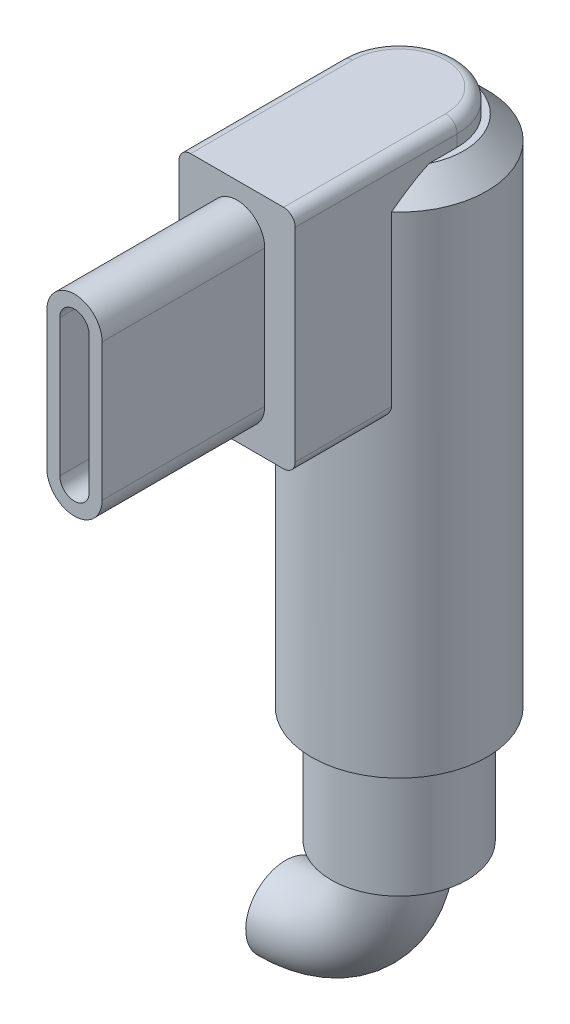
ISO-10303-21;
HEADER;
FILE_DESCRIPTION(('STEP AP214'),'2;1');
FILE_NAME('part.step','',(''),(''),'','','');
FILE_SCHEMA(('AUTOMOTIVE_DESIGN { 1 0 10303 214 1 1 1 1 }'));
ENDSEC;
DATA;
#1=APPLICATION_CONTEXT('core data for automotive mechanical design processes');
#2=APPLICATION_PROTOCOL_DEFINITION('international standard','automotive_design',2000,#1);
#3=PRODUCT_CONTEXT('',#1,'mechanical');
#4=PRODUCT('Part','Part','',(#3));
#5=PRODUCT_RELATED_PRODUCT_CATEGORY('part','',(#4));
#6=PRODUCT_DEFINITION_FORMATION('','',#4);
#7=PRODUCT_DEFINITION_CONTEXT('part definition',#1,'design');
#8=PRODUCT_DEFINITION('design','',#6,#7);
#9=PRODUCT_DEFINITION_SHAPE('','',#8);
#10=(LENGTH_UNIT() NAMED_UNIT(*) SI_UNIT(.MILLI.,.METRE.));
#11=(NAMED_UNIT(*) PLANE_ANGLE_UNIT() SI_UNIT($,.RADIAN.));
#12=(NAMED_UNIT(*) SI_UNIT($,.STERADIAN.) SOLID_ANGLE_UNIT());
#13=UNCERTAINTY_MEASURE_WITH_UNIT(LENGTH_MEASURE(1.E-05),#10,'distance_accuracy_value','');
#14=(GEOMETRIC_REPRESENTATION_CONTEXT(3) GLOBAL_UNCERTAINTY_ASSIGNED_CONTEXT((#13)) GLOBAL_UNIT_ASSIGNED_CONTEXT((#10,
#11,#12)) REPRESENTATION_CONTEXT('',''));
#15=CARTESIAN_POINT('',(0.,0.,0.));
#16=DIRECTION('',(0.,0.,1.));
#17=DIRECTION('',(1.,0.,0.));
#18=AXIS2_PLACEMENT_3D('',#15,#16,#17);
#19=CARTESIAN_POINT('',(0.,28.1,0.));
#20=DIRECTION('',(0.,-1.,0.));
#21=DIRECTION('',(0.,0.,-1.));
#22=AXIS2_PLACEMENT_3D('',#19,#20,#21);
#23=CYLINDRICAL_SURFACE('',#22,3.775);
#24=CARTESIAN_POINT('',(0.,5.,0.));
#25=DIRECTION('',(0.,1.,0.));
#26=DIRECTION('',(0.,0.,1.));
#27=AXIS2_PLACEMENT_3D('',#24,#25,#26);
#28=CIRCLE('',#27,3.775);
#29=CARTESIAN_POINT('',(0.,5.,3.775));
#30=VERTEX_POINT('',#29);
#31=EDGE_CURVE('E335',#30,#30,#28,.T.);
#32=ORIENTED_EDGE('',*,*,#31,.T.);
#33=EDGE_LOOP('',(#32));
#34=FACE_BOUND('',#33,.T.);
#35=DIRECTION('',(0.,-1.,0.));
#36=VECTOR('',#35,1.);
#37=CARTESIAN_POINT('',(-2.5,28.1,2.82853760802292));
#38=LINE('',#37,#36);
#39=CARTESIAN_POINT('',(-2.5,26.1,2.82853760802292));
#40=VERTEX_POINT('',#39);
#41=CARTESIAN_POINT('',(-2.5,18.85,2.82853760802292));
#42=VERTEX_POINT('',#41);
#43=EDGE_CURVE('E308',#40,#42,#38,.T.);
#44=ORIENTED_EDGE('',*,*,#43,.F.);
#45=CARTESIAN_POINT('',(0.,26.1,0.));
#46=DIRECTION('',(0.,1.,0.));
#47=DIRECTION('',(0.,0.,1.));
#48=AXIS2_PLACEMENT_3D('',#45,#46,#47);
#49=CIRCLE('',#48,3.775);
#50=CARTESIAN_POINT('',(2.5,26.1,2.82853760802292));
#51=VERTEX_POINT('',#50);
#52=EDGE_CURVE('E350',#40,#51,#49,.F.);
#53=ORIENTED_EDGE('',*,*,#52,.T.);
#54=DIRECTION('',(0.,-1.,0.));
#55=VECTOR('',#54,1.);
#56=CARTESIAN_POINT('',(2.5,28.1,2.82853760802292));
#57=LINE('',#56,#55);
#58=CARTESIAN_POINT('',(2.5,18.85,2.82853760802292));
#59=VERTEX_POINT('',#58);
#60=EDGE_CURVE('E312',#59,#51,#57,.F.);
#61=ORIENTED_EDGE('',*,*,#60,.F.);
#62=CARTESIAN_POINT('',(2.5,18.85,2.82853760802292));
#63=CARTESIAN_POINT('',(2.5000369379469,18.826457102281,2.82849614022547));
#64=CARTESIAN_POINT('',(2.49833999016514,18.8029734489008,2.8300050813574));
#65=CARTESIAN_POINT('',(2.49180621462881,18.7569883192918,2.8357641199373));
#66=CARTESIAN_POINT('',(2.48699602477203,18.734480223276,2.83999096019166));
#67=CARTESIAN_POINT('',(2.47457109758775,18.6909498361622,2.85082196215042));
#68=CARTESIAN_POINT('',(2.46696411444391,18.6699236267678,2.85741954976028));
#69=CARTESIAN_POINT('',(2.44934553663139,18.6296058667352,2.87253677117939));
#70=CARTESIAN_POINT('',(2.43932823042136,18.6103185882128,2.88106096735652));
#71=CARTESIAN_POINT('',(2.41313053460092,18.5668250708692,2.90307005166998));
#72=CARTESIAN_POINT('',(2.39604895389874,18.5434955124402,2.91721512620181));
#73=CARTESIAN_POINT('',(2.35890477449549,18.5007264201281,2.94733217504659));
#74=CARTESIAN_POINT('',(2.33883833515682,18.4812919748771,2.96330649687753));
#75=CARTESIAN_POINT('',(2.2959948591727,18.4460586800113,2.99662818692633));
#76=CARTESIAN_POINT('',(2.27317815287008,18.4303259628401,3.0139940295335));
#77=CARTESIAN_POINT('',(2.22562996398549,18.4029615910862,3.04927452193336));
#78=CARTESIAN_POINT('',(2.2008993059963,18.3913281822522,3.06718893339641));
#79=CARTESIAN_POINT('',(2.14758041771138,18.3713521145292,3.10478245415861));
#80=CARTESIAN_POINT('',(2.11884692516726,18.3634130958183,3.12447160106304));
#81=CARTESIAN_POINT('',(2.06017590948722,18.3527419858257,3.16347465852328));
#82=CARTESIAN_POINT('',(2.03023807377893,18.3500112553102,3.18278846971109));
#83=CARTESIAN_POINT('',(2.,18.35,3.20165972582971));
#84=B_SPLINE_CURVE_WITH_KNOTS('',3,(#62,#63,#64,#65,#66,#67,#68,#69,#70,#71,#72,#73,#74,#75,#76,
#77,#78,#79,#80,#81,#82,#83),.UNSPECIFIED.,.F.,.F.,(4,2,2,2,2,2,2,2,2,2,4),(0.,
0.0704255173164462,0.140256278059766,0.209894873453453,0.279700139499729,0.375748188194619,
0.471920909067463,0.569699667782268,0.667436532255682,0.774208802935048,0.881008966119465),.UNSPECIFIED.);
#85=CARTESIAN_POINT('',(2.,18.35,3.20165972582971));
#86=VERTEX_POINT('',#85);
#87=EDGE_CURVE('E66',#59,#86,#84,.T.);
#88=ORIENTED_EDGE('',*,*,#87,.T.);
#89=CARTESIAN_POINT('',(0.,18.35,0.));
#90=DIRECTION('',(0.,-1.,0.));
#91=DIRECTION('',(0.,0.,-1.));
#92=AXIS2_PLACEMENT_3D('',#89,#90,#91);
#93=CIRCLE('',#92,3.775);
#94=CARTESIAN_POINT('',(-2.,18.35,3.20165972582971));
#95=VERTEX_POINT('',#94);
#96=EDGE_CURVE('E313',#95,#86,#93,.F.);
#97=ORIENTED_EDGE('',*,*,#96,.F.);
#98=CARTESIAN_POINT('',(-2.,18.35,3.20165972582971));
#99=CARTESIAN_POINT('',(-2.03606850331327,18.3500248556165,3.17916413676862));
#100=CARTESIAN_POINT('',(-2.07169973642586,18.3539008427553,3.15602520589106));
#101=CARTESIAN_POINT('',(-2.14125396079077,18.3690368250493,3.10923780757989));
#102=CARTESIAN_POINT('',(-2.17516849392718,18.3803301489529,3.08558750846223));
#103=CARTESIAN_POINT('',(-2.23803482981118,18.4090282202888,3.04027084309099));
#104=CARTESIAN_POINT('',(-2.26716529912488,18.4259959942354,3.01857431952126));
#105=CARTESIAN_POINT('',(-2.32202388109657,18.4660088804958,2.97657728094078));
#106=CARTESIAN_POINT('',(-2.3477595846894,18.4890400765204,2.95627370177127));
#107=CARTESIAN_POINT('',(-2.38792576050043,18.533560461974,2.92385018278229));
#108=CARTESIAN_POINT('',(-2.40347132912667,18.5535630200646,2.91106357384926));
#109=CARTESIAN_POINT('',(-2.43175099167725,18.5965245498283,2.88748151207099));
#110=CARTESIAN_POINT('',(-2.44448880345045,18.6194795474763,2.87668342930648));
#111=CARTESIAN_POINT('',(-2.46450272287878,18.6636785490475,2.85954428843174));
#112=CARTESIAN_POINT('',(-2.4723490863816,18.6844878771238,2.85275091864194));
#113=CARTESIAN_POINT('',(-2.48528644191277,18.7275291285085,2.84148739434813));
#114=CARTESIAN_POINT('',(-2.49038316632742,18.7497579832965,2.83701240731115));
#115=CARTESIAN_POINT('',(-2.49594463538548,18.7851457922843,2.83211799873875));
#116=CARTESIAN_POINT('',(-2.49746022269047,18.7980242100382,2.83078089201309));
#117=CARTESIAN_POINT('',(-2.49948971376825,18.8239320499596,2.82898865745538));
#118=CARTESIAN_POINT('',(-2.5000026982415,18.8369615997031,2.82853433906561));
#119=CARTESIAN_POINT('',(-2.5,18.85,2.82853760802291));
#120=B_SPLINE_CURVE_WITH_KNOTS('',3,(#98,#99,#100,#101,#102,#103,#104,#105,#106,#107,#108,#109,
#110,#111,#112,#113,#114,#115,#116,#117,#118,#119),.UNSPECIFIED.,.F.,.F.,(4,2,2,2,2,2,2,2,2,2,
4),(0.,0.127315986871851,0.255208000196736,0.374921949854657,0.494363501149973,
0.579198459174759,0.663920400317473,0.733406456844945,0.802747085029367,0.841792147011757,
0.880872993153382),.UNSPECIFIED.);
#121=EDGE_CURVE('E394',#95,#42,#120,.T.);
#122=ORIENTED_EDGE('',*,*,#121,.T.);
#123=EDGE_LOOP('',(#44,#53,#61,#88,#97,#122));
#124=FACE_BOUND('',#123,.T.);
#125=ADVANCED_FACE('F55',(#34,#124),#23,.T.);
#126=CARTESIAN_POINT('',(0.,0.,6.975));
#127=DIRECTION('',(0.,0.,1.));
#128=DIRECTION('',(1.,0.,0.));
#129=AXIS2_PLACEMENT_3D('',#126,#127,#128);
#130=PLANE('',#129);
#131=DIRECTION('',(0.,-1.,0.));
#132=VECTOR('',#131,1.);
#133=CARTESIAN_POINT('',(-2.5,28.1,6.975));
#134=LINE('',#133,#132);
#135=CARTESIAN_POINT('',(-2.5,27.6,6.975));
#136=VERTEX_POINT('',#135);
#137=CARTESIAN_POINT('',(-2.5,18.85,6.975));
#138=VERTEX_POINT('',#137);
#139=EDGE_CURVE('E317',#136,#138,#134,.T.);
#140=ORIENTED_EDGE('',*,*,#139,.T.);
#141=CARTESIAN_POINT('',(-2.,18.85,6.975));
#142=DIRECTION('',(0.,0.,1.));
#143=DIRECTION('',(1.,0.,0.));
#144=AXIS2_PLACEMENT_3D('',#141,#142,#143);
#145=CIRCLE('',#144,0.5);
#146=CARTESIAN_POINT('',(-2.,18.35,6.975));
#147=VERTEX_POINT('',#146);
#148=EDGE_CURVE('E507',#138,#147,#145,.T.);
#149=ORIENTED_EDGE('',*,*,#148,.T.);
#150=DIRECTION('',(1.,0.,0.));
#151=VECTOR('',#150,1.);
#152=CARTESIAN_POINT('',(-2.5,18.35,6.975));
#153=LINE('',#152,#151);
#154=CARTESIAN_POINT('',(2.,18.35,6.975));
#155=VERTEX_POINT('',#154);
#156=EDGE_CURVE('E323',#147,#155,#153,.T.);
#157=ORIENTED_EDGE('',*,*,#156,.T.);
#158=CARTESIAN_POINT('',(2.,18.85,6.975));
#159=DIRECTION('',(0.,0.,1.));
#160=DIRECTION('',(1.,0.,0.));
#161=AXIS2_PLACEMENT_3D('',#158,#159,#160);
#162=CIRCLE('',#161,0.5);
#163=CARTESIAN_POINT('',(2.5,18.85,6.975));
#164=VERTEX_POINT('',#163);
#165=EDGE_CURVE('E522',#155,#164,#162,.T.);
#166=ORIENTED_EDGE('',*,*,#165,.T.);
#167=DIRECTION('',(0.,1.,0.));
#168=VECTOR('',#167,1.);
#169=CARTESIAN_POINT('',(2.5,28.1,6.975));
#170=LINE('',#169,#168);
#171=CARTESIAN_POINT('',(2.5,27.6,6.975));
#172=VERTEX_POINT('',#171);
#173=EDGE_CURVE('E327',#164,#172,#170,.T.);
#174=ORIENTED_EDGE('',*,*,#173,.T.);
#175=CARTESIAN_POINT('',(2.,27.6,6.975));
#176=DIRECTION('',(0.,0.,1.));
#177=DIRECTION('',(1.,0.,0.));
#178=AXIS2_PLACEMENT_3D('',#175,#176,#177);
#179=CIRCLE('',#178,0.5);
#180=CARTESIAN_POINT('',(2.,28.1,6.975));
#181=VERTEX_POINT('',#180);
#182=EDGE_CURVE('E519',#172,#181,#179,.T.);
#183=ORIENTED_EDGE('',*,*,#182,.T.);
#184=DIRECTION('',(-1.,0.,0.));
#185=VECTOR('',#184,1.);
#186=CARTESIAN_POINT('',(-2.5,28.1,6.975));
#187=LINE('',#186,#185);
#188=CARTESIAN_POINT('',(-2.,28.1,6.975));
#189=VERTEX_POINT('',#188);
#190=EDGE_CURVE('E331',#181,#189,#187,.T.);
#191=ORIENTED_EDGE('',*,*,#190,.T.);
#192=CARTESIAN_POINT('',(-2.,27.6,6.975));
#193=DIRECTION('',(0.,0.,1.));
#194=DIRECTION('',(1.,0.,0.));
#195=AXIS2_PLACEMENT_3D('',#192,#193,#194);
#196=CIRCLE('',#195,0.5);
#197=EDGE_CURVE('E525',#189,#136,#196,.T.);
#198=ORIENTED_EDGE('',*,*,#197,.T.);
#199=EDGE_LOOP('',(#140,#149,#157,#166,#174,#183,#191,#198));
#200=FACE_BOUND('',#199,.T.);
#201=DIRECTION('',(0.,-1.,0.));
#202=VECTOR('',#201,1.);
#203=CARTESIAN_POINT('',(-1.19,26.175,6.975));
#204=LINE('',#203,#202);
#205=CARTESIAN_POINT('',(-1.19,26.175,6.975));
#206=VERTEX_POINT('',#205);
#207=CARTESIAN_POINT('',(-1.19,20.275,6.975));
#208=VERTEX_POINT('',#207);
#209=EDGE_CURVE('E286',#206,#208,#204,.T.);
#210=ORIENTED_EDGE('',*,*,#209,.F.);
#211=CARTESIAN_POINT('',(0.,26.175,6.975));
#212=DIRECTION('',(0.,0.,1.));
#213=DIRECTION('',(1.,0.,0.));
#214=AXIS2_PLACEMENT_3D('',#211,#212,#213);
#215=CIRCLE('',#214,1.19);
#216=CARTESIAN_POINT('',(1.19,26.175,6.975));
#217=VERTEX_POINT('',#216);
#218=EDGE_CURVE('E267',#217,#206,#215,.T.);
#219=ORIENTED_EDGE('',*,*,#218,.F.);
#220=DIRECTION('',(0.,1.,0.));
#221=VECTOR('',#220,1.);
#222=CARTESIAN_POINT('',(1.19,26.175,6.975));
#223=LINE('',#222,#221);
#224=CARTESIAN_POINT('',(1.19,20.275,6.975));
#225=VERTEX_POINT('',#224);
#226=EDGE_CURVE('E273',#225,#217,#223,.T.);
#227=ORIENTED_EDGE('',*,*,#226,.F.);
#228=CARTESIAN_POINT('',(0.,20.275,6.975));
#229=DIRECTION('',(0.,0.,1.));
#230=DIRECTION('',(1.,0.,0.));
#231=AXIS2_PLACEMENT_3D('',#228,#229,#230);
#232=CIRCLE('',#231,1.19);
#233=EDGE_CURVE('E289',#208,#225,#232,.T.);
#234=ORIENTED_EDGE('',*,*,#233,.F.);
#235=EDGE_LOOP('',(#210,#219,#227,#234));
#236=FACE_BOUND('',#235,.T.);
#237=ADVANCED_FACE('F412',(#200,#236),#130,.T.);
#238=CARTESIAN_POINT('',(0.,5.,0.));
#239=DIRECTION('',(0.,-1.,0.));
#240=DIRECTION('',(0.,0.,-1.));
#241=AXIS2_PLACEMENT_3D('',#238,#239,#240);
#242=CYLINDRICAL_SURFACE('',#241,2.925);
#243=CARTESIAN_POINT('',(0.,5.,0.));
#244=DIRECTION('',(0.,1.,0.));
#245=DIRECTION('',(0.,0.,1.));
#246=AXIS2_PLACEMENT_3D('',#243,#244,#245);
#247=CIRCLE('',#246,2.925);
#248=CARTESIAN_POINT('',(0.,5.,2.925));
#249=VERTEX_POINT('',#248);
#250=EDGE_CURVE('E340',#249,#249,#247,.T.);
#251=ORIENTED_EDGE('',*,*,#250,.F.);
#252=EDGE_LOOP('',(#251));
#253=FACE_BOUND('',#252,.T.);
#254=CARTESIAN_POINT('',(0.,0.,0.));
#255=DIRECTION('',(0.,1.,0.));
#256=DIRECTION('',(0.,0.,1.));
#257=AXIS2_PLACEMENT_3D('',#254,#255,#256);
#258=CIRCLE('',#257,2.925);
#259=CARTESIAN_POINT('',(0.,0.,2.925));
#260=VERTEX_POINT('',#259);
#261=EDGE_CURVE('E339',#260,#260,#258,.T.);
#262=ORIENTED_EDGE('',*,*,#261,.T.);
#263=EDGE_LOOP('',(#262));
#264=FACE_BOUND('',#263,.T.);
#265=ADVANCED_FACE('F383',(#253,#264),#242,.T.);
#266=CARTESIAN_POINT('',(0.,0.,0.));
#267=DIRECTION('',(0.,1.,0.));
#268=DIRECTION('',(0.,0.,1.));
#269=AXIS2_PLACEMENT_3D('',#266,#267,#268);
#270=PLANE('',#269);
#271=CARTESIAN_POINT('',(0.,0.,0.));
#272=DIRECTION('',(0.,-1.,0.));
#273=DIRECTION('',(0.,0.,-1.));
#274=AXIS2_PLACEMENT_3D('',#271,#272,#273);
#275=CIRCLE('',#274,1.7145);
#276=CARTESIAN_POINT('',(1.7145,0.,0.));
#277=VERTEX_POINT('',#276);
#278=EDGE_CURVE('E13',#277,#277,#275,.T.);
#279=ORIENTED_EDGE('',*,*,#278,.F.);
#280=EDGE_LOOP('',(#279));
#281=FACE_BOUND('',#280,.T.);
#282=ORIENTED_EDGE('',*,*,#261,.F.);
#283=EDGE_LOOP('',(#282));
#284=FACE_BOUND('',#283,.T.);
#285=ADVANCED_FACE('F415',(#281,#284),#270,.F.);
#286=CARTESIAN_POINT('',(0.,28.1,0.));
#287=DIRECTION('',(0.,1.,0.));
#288=DIRECTION('',(0.,0.,1.));
#289=AXIS2_PLACEMENT_3D('',#286,#287,#288);
#290=PLANE('',#289);
#291=CARTESIAN_POINT('',(0.,28.1,0.));
#292=DIRECTION('',(0.,1.,0.));
#293=DIRECTION('',(0.,0.,1.));
#294=AXIS2_PLACEMENT_3D('',#291,#292,#293);
#295=CIRCLE('',#294,2.);
#296=CARTESIAN_POINT('',(2.,28.1,0.));
#297=VERTEX_POINT('',#296);
#298=CARTESIAN_POINT('',(-2.,28.1,0.));
#299=VERTEX_POINT('',#298);
#300=EDGE_CURVE('E533',#297,#299,#295,.T.);
#301=ORIENTED_EDGE('',*,*,#300,.T.);
#302=DIRECTION('',(0.,0.,-1.));
#303=VECTOR('',#302,1.);
#304=CARTESIAN_POINT('',(-2.,28.1,6.975));
#305=LINE('',#304,#303);
#306=EDGE_CURVE('E536',#299,#189,#305,.F.);
#307=ORIENTED_EDGE('',*,*,#306,.T.);
#308=ORIENTED_EDGE('',*,*,#190,.F.);
#309=DIRECTION('',(0.,0.,-1.));
#310=VECTOR('',#309,1.);
#311=CARTESIAN_POINT('',(2.,28.1,0.));
#312=LINE('',#311,#310);
#313=EDGE_CURVE('E530',#181,#297,#312,.T.);
#314=ORIENTED_EDGE('',*,*,#313,.T.);
#315=EDGE_LOOP('',(#301,#307,#308,#314));
#316=FACE_BOUND('',#315,.T.);
#317=ADVANCED_FACE('F418',(#316),#290,.T.);
#318=CARTESIAN_POINT('',(0.,5.,0.));
#319=DIRECTION('',(0.,1.,0.));
#320=DIRECTION('',(0.,0.,1.));
#321=AXIS2_PLACEMENT_3D('',#318,#319,#320);
#322=PLANE('',#321);
#323=ORIENTED_EDGE('',*,*,#250,.T.);
#324=EDGE_LOOP('',(#323));
#325=FACE_BOUND('',#324,.T.);
#326=ORIENTED_EDGE('',*,*,#31,.F.);
#327=EDGE_LOOP('',(#326));
#328=FACE_BOUND('',#327,.T.);
#329=ADVANCED_FACE('F414',(#325,#328),#322,.F.);
#330=CARTESIAN_POINT('',(-2.5,28.1,6.975));
#331=DIRECTION('',(1.,0.,0.));
#332=DIRECTION('',(0.,1.,0.));
#333=AXIS2_PLACEMENT_3D('',#330,#331,#332);
#334=PLANE('',#333);
#335=ORIENTED_EDGE('',*,*,#43,.T.);
#336=DIRECTION('',(0.,0.,-1.));
#337=VECTOR('',#336,1.);
#338=CARTESIAN_POINT('',(-2.5,18.85,6.975));
#339=LINE('',#338,#337);
#340=EDGE_CURVE('E514',#42,#138,#339,.F.);
#341=ORIENTED_EDGE('',*,*,#340,.T.);
#342=ORIENTED_EDGE('',*,*,#139,.F.);
#343=DIRECTION('',(0.,0.,-1.));
#344=VECTOR('',#343,1.);
#345=CARTESIAN_POINT('',(-2.5,27.6,0.));
#346=LINE('',#345,#344);
#347=CARTESIAN_POINT('',(-2.5,27.6,0.));
#348=VERTEX_POINT('',#347);
#349=EDGE_CURVE('E509',#136,#348,#346,.T.);
#350=ORIENTED_EDGE('',*,*,#349,.T.);
#351=DIRECTION('',(0.,1.,0.));
#352=VECTOR('',#351,1.);
#353=CARTESIAN_POINT('',(-2.5,27.1,0.));
#354=LINE('',#353,#352);
#355=CARTESIAN_POINT('',(-2.5,27.1,0.));
#356=VERTEX_POINT('',#355);
#357=EDGE_CURVE('E197',#356,#348,#354,.T.);
#358=ORIENTED_EDGE('',*,*,#357,.F.);
#359=DIRECTION('',(0.,0.,-1.));
#360=VECTOR('',#359,1.);
#361=CARTESIAN_POINT('',(-2.5,27.1,0.));
#362=LINE('',#361,#360);
#363=CARTESIAN_POINT('',(-2.5,27.1,1.20441894704457));
#364=VERTEX_POINT('',#363);
#365=EDGE_CURVE('E198',#364,#356,#362,.T.);
#366=ORIENTED_EDGE('',*,*,#365,.F.);
#367=CARTESIAN_POINT('',(-2.5,27.1,1.20441894704457));
#368=CARTESIAN_POINT('',(-2.5,27.06817489987,1.27769798374855));
#369=CARTESIAN_POINT('',(-2.5,27.0344138305237,1.3501012406047));
#370=CARTESIAN_POINT('',(-2.5,26.9636575458132,1.49325643323808));
#371=CARTESIAN_POINT('',(-2.5,26.9266644504029,1.56400941344375));
#372=CARTESIAN_POINT('',(-2.5,26.8501576305321,1.70384225563926));
#373=CARTESIAN_POINT('',(-2.5,26.8106520753071,1.77292662426145));
#374=CARTESIAN_POINT('',(-2.5,26.729468136726,1.90981786602526));
#375=CARTESIAN_POINT('',(-2.5,26.6877893640542,1.97762450728912));
#376=CARTESIAN_POINT('',(-2.5,26.5602247200458,2.1791237837645));
#377=CARTESIAN_POINT('',(-2.5,26.4716772433656,2.31113321834032));
#378=CARTESIAN_POINT('',(-2.5,26.3350114179661,2.50672696361921));
#379=CARTESIAN_POINT('',(-2.5,26.2887375177751,2.57162431907002));
#380=CARTESIAN_POINT('',(-2.5,26.1951252312258,2.70063805607783));
#381=CARTESIAN_POINT('',(-2.5,26.1477869455196,2.76475451060295));
#382=CARTESIAN_POINT('',(-2.5,26.1,2.82853760802291));
#383=B_SPLINE_CURVE_WITH_KNOTS('',3,(#367,#368,#369,#370,#371,#372,#373,#374,#375,#376,#377,
#378,#379,#380,#381,#382),.UNSPECIFIED.,.F.,.F.,(4,2,2,2,2,2,2,4),(0.,0.239599889392296,
0.479043783407813,0.717745420353795,0.956489966819155,1.43316333775114,1.67227360257733,
1.9113613505981),.UNSPECIFIED.);
#384=EDGE_CURVE('E354',#364,#40,#383,.T.);
#385=ORIENTED_EDGE('',*,*,#384,.T.);
#386=EDGE_LOOP('',(#335,#341,#342,#350,#358,#366,#385));
#387=FACE_BOUND('',#386,.T.);
#388=ADVANCED_FACE('F369',(#387),#334,.F.);
#389=CARTESIAN_POINT('',(-2.5,18.35,6.975));
#390=DIRECTION('',(0.,1.,0.));
#391=DIRECTION('',(0.,0.,1.));
#392=AXIS2_PLACEMENT_3D('',#389,#390,#391);
#393=PLANE('',#392);
#394=ORIENTED_EDGE('',*,*,#156,.F.);
#395=DIRECTION('',(0.,0.,-1.));
#396=VECTOR('',#395,1.);
#397=CARTESIAN_POINT('',(-2.,18.35,6.975));
#398=LINE('',#397,#396);
#399=EDGE_CURVE('E500',#147,#95,#398,.T.);
#400=ORIENTED_EDGE('',*,*,#399,.T.);
#401=ORIENTED_EDGE('',*,*,#96,.T.);
#402=DIRECTION('',(0.,0.,-1.));
#403=VECTOR('',#402,1.);
#404=CARTESIAN_POINT('',(2.,18.35,6.975));
#405=LINE('',#404,#403);
#406=EDGE_CURVE('E502',#86,#155,#405,.F.);
#407=ORIENTED_EDGE('',*,*,#406,.T.);
#408=EDGE_LOOP('',(#394,#400,#401,#407));
#409=FACE_BOUND('',#408,.T.);
#410=ADVANCED_FACE('F490',(#409),#393,.F.);
#411=CARTESIAN_POINT('',(2.5,28.1,6.975));
#412=DIRECTION('',(-1.,0.,0.));
#413=DIRECTION('',(0.,-1.,0.));
#414=AXIS2_PLACEMENT_3D('',#411,#412,#413);
#415=PLANE('',#414);
#416=ORIENTED_EDGE('',*,*,#173,.F.);
#417=DIRECTION('',(0.,0.,-1.));
#418=VECTOR('',#417,1.);
#419=CARTESIAN_POINT('',(2.5,18.85,6.975));
#420=LINE('',#419,#418);
#421=EDGE_CURVE('E403',#164,#59,#420,.T.);
#422=ORIENTED_EDGE('',*,*,#421,.T.);
#423=ORIENTED_EDGE('',*,*,#60,.T.);
#424=CARTESIAN_POINT('',(2.5,26.1,2.82853760802292));
#425=CARTESIAN_POINT('',(2.5,26.1477869455196,2.76475451060296));
#426=CARTESIAN_POINT('',(2.5,26.1951252312258,2.70063805607783));
#427=CARTESIAN_POINT('',(2.5,26.2887375177751,2.57162431907002));
#428=CARTESIAN_POINT('',(2.5,26.3350114179661,2.50672696361921));
#429=CARTESIAN_POINT('',(2.5,26.4716772433656,2.31113321834032));
#430=CARTESIAN_POINT('',(2.5,26.5602247200458,2.1791237837645));
#431=CARTESIAN_POINT('',(2.5,26.6877893640542,1.97762450728912));
#432=CARTESIAN_POINT('',(2.5,26.729468136726,1.90981786602526));
#433=CARTESIAN_POINT('',(2.5,26.8106520753071,1.77292662426145));
#434=CARTESIAN_POINT('',(2.5,26.8501576305321,1.70384225563926));
#435=CARTESIAN_POINT('',(2.5,26.9266644504029,1.56400941344376));
#436=CARTESIAN_POINT('',(2.5,26.9636575458132,1.49325643323808));
#437=CARTESIAN_POINT('',(2.5,27.0344138305237,1.3501012406047));
#438=CARTESIAN_POINT('',(2.5,27.06817489987,1.27769798374855));
#439=CARTESIAN_POINT('',(2.5,27.1,1.20441894704458));
#440=B_SPLINE_CURVE_WITH_KNOTS('',3,(#424,#425,#426,#427,#428,#429,#430,#431,#432,#433,#434,
#435,#436,#437,#438,#439),.UNSPECIFIED.,.F.,.F.,(4,2,2,2,2,2,2,4),(0.,0.239087748020767,
0.478198012846965,0.954871383778947,1.19361593024431,1.43231756719029,1.6717614612058,
1.9113613505981),.UNSPECIFIED.);
#441=CARTESIAN_POINT('',(2.5,27.1,1.20441894704457));
#442=VERTEX_POINT('',#441);
#443=EDGE_CURVE('E205',#51,#442,#440,.T.);
#444=ORIENTED_EDGE('',*,*,#443,.T.);
#445=DIRECTION('',(0.,0.,1.));
#446=VECTOR('',#445,1.);
#447=CARTESIAN_POINT('',(2.5,27.1,0.));
#448=LINE('',#447,#446);
#449=CARTESIAN_POINT('',(2.5,27.1,0.));
#450=VERTEX_POINT('',#449);
#451=EDGE_CURVE('E201',#450,#442,#448,.T.);
#452=ORIENTED_EDGE('',*,*,#451,.F.);
#453=DIRECTION('',(0.,1.,0.));
#454=VECTOR('',#453,1.);
#455=CARTESIAN_POINT('',(2.5,27.1,0.));
#456=LINE('',#455,#454);
#457=CARTESIAN_POINT('',(2.5,27.6,0.));
#458=VERTEX_POINT('',#457);
#459=EDGE_CURVE('E189',#450,#458,#456,.T.);
#460=ORIENTED_EDGE('',*,*,#459,.T.);
#461=DIRECTION('',(0.,0.,-1.));
#462=VECTOR('',#461,1.);
#463=CARTESIAN_POINT('',(2.5,27.6,6.975));
#464=LINE('',#463,#462);
#465=EDGE_CURVE('E540',#458,#172,#464,.F.);
#466=ORIENTED_EDGE('',*,*,#465,.T.);
#467=EDGE_LOOP('',(#416,#422,#423,#444,#452,#460,#466));
#468=FACE_BOUND('',#467,.T.);
#469=ADVANCED_FACE('F203',(#468),#415,.F.);
#470=CARTESIAN_POINT('',(0.,26.175,13.975));
#471=DIRECTION('',(0.,0.,1.));
#472=DIRECTION('',(1.,0.,0.));
#473=AXIS2_PLACEMENT_3D('',#470,#471,#472);
#474=PLANE('',#473);
#475=CARTESIAN_POINT('',(0.,26.175,13.975));
#476=DIRECTION('',(0.,0.,1.));
#477=DIRECTION('',(1.,0.,0.));
#478=AXIS2_PLACEMENT_3D('',#475,#476,#477);
#479=CIRCLE('',#478,1.19);
#480=CARTESIAN_POINT('',(1.19,26.175,13.975));
#481=VERTEX_POINT('',#480);
#482=CARTESIAN_POINT('',(-1.19,26.175,13.975));
#483=VERTEX_POINT('',#482);
#484=EDGE_CURVE('E268',#481,#483,#479,.T.);
#485=ORIENTED_EDGE('',*,*,#484,.T.);
#486=DIRECTION('',(0.,-1.,0.));
#487=VECTOR('',#486,1.);
#488=CARTESIAN_POINT('',(-1.19,26.175,13.975));
#489=LINE('',#488,#487);
#490=CARTESIAN_POINT('',(-1.19,20.275,13.975));
#491=VERTEX_POINT('',#490);
#492=EDGE_CURVE('E272',#483,#491,#489,.T.);
#493=ORIENTED_EDGE('',*,*,#492,.T.);
#494=CARTESIAN_POINT('',(0.,20.275,13.975));
#495=DIRECTION('',(0.,0.,1.));
#496=DIRECTION('',(1.,0.,0.));
#497=AXIS2_PLACEMENT_3D('',#494,#495,#496);
#498=CIRCLE('',#497,1.19);
#499=CARTESIAN_POINT('',(1.19,20.275,13.975));
#500=VERTEX_POINT('',#499);
#501=EDGE_CURVE('E276',#491,#500,#498,.T.);
#502=ORIENTED_EDGE('',*,*,#501,.T.);
#503=DIRECTION('',(0.,1.,0.));
#504=VECTOR('',#503,1.);
#505=CARTESIAN_POINT('',(1.19,26.175,13.975));
#506=LINE('',#505,#504);
#507=EDGE_CURVE('E279',#500,#481,#506,.T.);
#508=ORIENTED_EDGE('',*,*,#507,.T.);
#509=EDGE_LOOP('',(#485,#493,#502,#508));
#510=FACE_BOUND('',#509,.T.);
#511=DIRECTION('',(0.,-1.,0.));
#512=VECTOR('',#511,1.);
#513=CARTESIAN_POINT('',(-0.630000000000001,26.175,13.975));
#514=LINE('',#513,#512);
#515=CARTESIAN_POINT('',(-0.630000000000001,26.175,13.975));
#516=VERTEX_POINT('',#515);
#517=CARTESIAN_POINT('',(-0.630000000000004,20.275,13.975));
#518=VERTEX_POINT('',#517);
#519=EDGE_CURVE('E230',#516,#518,#514,.T.);
#520=ORIENTED_EDGE('',*,*,#519,.F.);
#521=CARTESIAN_POINT('',(0.,26.175,13.975));
#522=DIRECTION('',(0.,0.,1.));
#523=DIRECTION('',(1.,0.,0.));
#524=AXIS2_PLACEMENT_3D('',#521,#522,#523);
#525=CIRCLE('',#524,0.630000000000002);
#526=CARTESIAN_POINT('',(0.630000000000003,26.175,13.975));
#527=VERTEX_POINT('',#526);
#528=EDGE_CURVE('E227',#527,#516,#525,.T.);
#529=ORIENTED_EDGE('',*,*,#528,.F.);
#530=DIRECTION('',(0.,1.,0.));
#531=VECTOR('',#530,1.);
#532=CARTESIAN_POINT('',(0.630000000000003,26.175,13.975));
#533=LINE('',#532,#531);
#534=CARTESIAN_POINT('',(0.630000000000003,20.275,13.975));
#535=VERTEX_POINT('',#534);
#536=EDGE_CURVE('E238',#535,#527,#533,.T.);
#537=ORIENTED_EDGE('',*,*,#536,.F.);
#538=CARTESIAN_POINT('',(0.,20.275,13.975));
#539=DIRECTION('',(0.,0.,1.));
#540=DIRECTION('',(1.,0.,0.));
#541=AXIS2_PLACEMENT_3D('',#538,#539,#540);
#542=CIRCLE('',#541,0.630000000000002);
#543=EDGE_CURVE('E234',#518,#535,#542,.T.);
#544=ORIENTED_EDGE('',*,*,#543,.F.);
#545=EDGE_LOOP('',(#520,#529,#537,#544));
#546=FACE_BOUND('',#545,.T.);
#547=ADVANCED_FACE('F467',(#510,#546),#474,.T.);
#548=CARTESIAN_POINT('',(0.,26.175,13.975));
#549=DIRECTION('',(0.,0.,-1.));
#550=DIRECTION('',(-1.,0.,0.));
#551=AXIS2_PLACEMENT_3D('',#548,#549,#550);
#552=CYLINDRICAL_SURFACE('',#551,1.19);
#553=ORIENTED_EDGE('',*,*,#218,.T.);
#554=DIRECTION('',(0.,0.,-1.));
#555=VECTOR('',#554,1.);
#556=CARTESIAN_POINT('',(-1.19,26.175,13.975));
#557=LINE('',#556,#555);
#558=EDGE_CURVE('E305',#483,#206,#557,.T.);
#559=ORIENTED_EDGE('',*,*,#558,.F.);
#560=ORIENTED_EDGE('',*,*,#484,.F.);
#561=DIRECTION('',(0.,0.,-1.));
#562=VECTOR('',#561,1.);
#563=CARTESIAN_POINT('',(1.19,26.175,13.975));
#564=LINE('',#563,#562);
#565=EDGE_CURVE('E282',#481,#217,#564,.T.);
#566=ORIENTED_EDGE('',*,*,#565,.T.);
#567=EDGE_LOOP('',(#553,#559,#560,#566));
#568=FACE_BOUND('',#567,.T.);
#569=ADVANCED_FACE('F470',(#568),#552,.T.);
#570=CARTESIAN_POINT('',(-1.19,26.175,13.975));
#571=DIRECTION('',(1.,0.,0.));
#572=DIRECTION('',(0.,0.,-1.));
#573=AXIS2_PLACEMENT_3D('',#570,#571,#572);
#574=PLANE('',#573);
#575=ORIENTED_EDGE('',*,*,#209,.T.);
#576=DIRECTION('',(0.,0.,-1.));
#577=VECTOR('',#576,1.);
#578=CARTESIAN_POINT('',(-1.19,20.275,13.975));
#579=LINE('',#578,#577);
#580=EDGE_CURVE('E301',#491,#208,#579,.T.);
#581=ORIENTED_EDGE('',*,*,#580,.F.);
#582=ORIENTED_EDGE('',*,*,#492,.F.);
#583=ORIENTED_EDGE('',*,*,#558,.T.);
#584=EDGE_LOOP('',(#575,#581,#582,#583));
#585=FACE_BOUND('',#584,.T.);
#586=ADVANCED_FACE('F478',(#585),#574,.F.);
#587=CARTESIAN_POINT('',(0.,20.275,13.975));
#588=DIRECTION('',(0.,0.,-1.));
#589=DIRECTION('',(-1.,0.,0.));
#590=AXIS2_PLACEMENT_3D('',#587,#588,#589);
#591=CYLINDRICAL_SURFACE('',#590,1.19);
#592=ORIENTED_EDGE('',*,*,#233,.T.);
#593=DIRECTION('',(0.,0.,-1.));
#594=VECTOR('',#593,1.);
#595=CARTESIAN_POINT('',(1.19,20.275,13.975));
#596=LINE('',#595,#594);
#597=EDGE_CURVE('E298',#500,#225,#596,.T.);
#598=ORIENTED_EDGE('',*,*,#597,.F.);
#599=ORIENTED_EDGE('',*,*,#501,.F.);
#600=ORIENTED_EDGE('',*,*,#580,.T.);
#601=EDGE_LOOP('',(#592,#598,#599,#600));
#602=FACE_BOUND('',#601,.T.);
#603=ADVANCED_FACE('F474',(#602),#591,.T.);
#604=CARTESIAN_POINT('',(1.19,26.175,13.975));
#605=DIRECTION('',(-1.,0.,0.));
#606=DIRECTION('',(0.,0.,1.));
#607=AXIS2_PLACEMENT_3D('',#604,#605,#606);
#608=PLANE('',#607);
#609=ORIENTED_EDGE('',*,*,#226,.T.);
#610=ORIENTED_EDGE('',*,*,#565,.F.);
#611=ORIENTED_EDGE('',*,*,#507,.F.);
#612=ORIENTED_EDGE('',*,*,#597,.T.);
#613=EDGE_LOOP('',(#609,#610,#611,#612));
#614=FACE_BOUND('',#613,.T.);
#615=ADVANCED_FACE('F465',(#614),#608,.F.);
#616=CARTESIAN_POINT('',(0.,26.175,13.975));
#617=DIRECTION('',(0.,0.,-1.));
#618=DIRECTION('',(-1.,0.,0.));
#619=AXIS2_PLACEMENT_3D('',#616,#617,#618);
#620=CYLINDRICAL_SURFACE('',#619,0.630000000000002);
#621=CARTESIAN_POINT('',(0.,26.175,6.975));
#622=DIRECTION('',(0.,0.,1.));
#623=DIRECTION('',(1.,0.,0.));
#624=AXIS2_PLACEMENT_3D('',#621,#622,#623);
#625=CIRCLE('',#624,0.630000000000002);
#626=CARTESIAN_POINT('',(0.630000000000003,26.175,6.975));
#627=VERTEX_POINT('',#626);
#628=CARTESIAN_POINT('',(-0.630000000000001,26.175,6.975));
#629=VERTEX_POINT('',#628);
#630=EDGE_CURVE('E225',#627,#629,#625,.T.);
#631=ORIENTED_EDGE('',*,*,#630,.F.);
#632=DIRECTION('',(0.,0.,-1.));
#633=VECTOR('',#632,1.);
#634=CARTESIAN_POINT('',(0.630000000000003,26.175,13.975));
#635=LINE('',#634,#633);
#636=EDGE_CURVE('E241',#527,#627,#635,.T.);
#637=ORIENTED_EDGE('',*,*,#636,.F.);
#638=ORIENTED_EDGE('',*,*,#528,.T.);
#639=DIRECTION('',(0.,0.,-1.));
#640=VECTOR('',#639,1.);
#641=CARTESIAN_POINT('',(-0.630000000000001,26.175,13.975));
#642=LINE('',#641,#640);
#643=EDGE_CURVE('E263',#516,#629,#642,.T.);
#644=ORIENTED_EDGE('',*,*,#643,.T.);
#645=EDGE_LOOP('',(#631,#637,#638,#644));
#646=FACE_BOUND('',#645,.T.);
#647=ADVANCED_FACE('F461',(#646),#620,.F.);
#648=CARTESIAN_POINT('',(-0.630000000000001,26.175,13.975));
#649=DIRECTION('',(1.,0.,0.));
#650=DIRECTION('',(0.,0.,-1.));
#651=AXIS2_PLACEMENT_3D('',#648,#649,#650);
#652=PLANE('',#651);
#653=DIRECTION('',(0.,-1.,0.));
#654=VECTOR('',#653,1.);
#655=CARTESIAN_POINT('',(-0.630000000000001,26.175,6.975));
#656=LINE('',#655,#654);
#657=CARTESIAN_POINT('',(-0.630000000000004,20.275,6.975));
#658=VERTEX_POINT('',#657);
#659=EDGE_CURVE('E244',#629,#658,#656,.T.);
#660=ORIENTED_EDGE('',*,*,#659,.F.);
#661=ORIENTED_EDGE('',*,*,#643,.F.);
#662=ORIENTED_EDGE('',*,*,#519,.T.);
#663=DIRECTION('',(0.,0.,-1.));
#664=VECTOR('',#663,1.);
#665=CARTESIAN_POINT('',(-0.630000000000004,20.275,13.975));
#666=LINE('',#665,#664);
#667=EDGE_CURVE('E259',#518,#658,#666,.T.);
#668=ORIENTED_EDGE('',*,*,#667,.T.);
#669=EDGE_LOOP('',(#660,#661,#662,#668));
#670=FACE_BOUND('',#669,.T.);
#671=ADVANCED_FACE('F457',(#670),#652,.T.);
#672=CARTESIAN_POINT('',(0.,20.275,13.975));
#673=DIRECTION('',(0.,0.,-1.));
#674=DIRECTION('',(-1.,0.,0.));
#675=AXIS2_PLACEMENT_3D('',#672,#673,#674);
#676=CYLINDRICAL_SURFACE('',#675,0.630000000000002);
#677=CARTESIAN_POINT('',(0.,20.275,6.975));
#678=DIRECTION('',(0.,0.,1.));
#679=DIRECTION('',(1.,0.,0.));
#680=AXIS2_PLACEMENT_3D('',#677,#678,#679);
#681=CIRCLE('',#680,0.630000000000002);
#682=CARTESIAN_POINT('',(0.630000000000003,20.275,6.975));
#683=VERTEX_POINT('',#682);
#684=EDGE_CURVE('E247',#658,#683,#681,.T.);
#685=ORIENTED_EDGE('',*,*,#684,.F.);
#686=ORIENTED_EDGE('',*,*,#667,.F.);
#687=ORIENTED_EDGE('',*,*,#543,.T.);
#688=DIRECTION('',(0.,0.,-1.));
#689=VECTOR('',#688,1.);
#690=CARTESIAN_POINT('',(0.630000000000003,20.275,13.975));
#691=LINE('',#690,#689);
#692=EDGE_CURVE('E255',#535,#683,#691,.T.);
#693=ORIENTED_EDGE('',*,*,#692,.T.);
#694=EDGE_LOOP('',(#685,#686,#687,#693));
#695=FACE_BOUND('',#694,.T.);
#696=ADVANCED_FACE('F453',(#695),#676,.F.);
#697=CARTESIAN_POINT('',(0.630000000000003,26.175,13.975));
#698=DIRECTION('',(-1.,0.,0.));
#699=DIRECTION('',(0.,0.,1.));
#700=AXIS2_PLACEMENT_3D('',#697,#698,#699);
#701=PLANE('',#700);
#702=DIRECTION('',(0.,1.,0.));
#703=VECTOR('',#702,1.);
#704=CARTESIAN_POINT('',(0.630000000000003,26.175,6.975));
#705=LINE('',#704,#703);
#706=EDGE_CURVE('E231',#683,#627,#705,.T.);
#707=ORIENTED_EDGE('',*,*,#706,.F.);
#708=ORIENTED_EDGE('',*,*,#692,.F.);
#709=ORIENTED_EDGE('',*,*,#536,.T.);
#710=ORIENTED_EDGE('',*,*,#636,.T.);
#711=EDGE_LOOP('',(#707,#708,#709,#710));
#712=FACE_BOUND('',#711,.T.);
#713=ADVANCED_FACE('F450',(#712),#701,.T.);
#714=ORIENTED_EDGE('',*,*,#630,.T.);
#715=ORIENTED_EDGE('',*,*,#659,.T.);
#716=ORIENTED_EDGE('',*,*,#684,.T.);
#717=ORIENTED_EDGE('',*,*,#706,.T.);
#718=EDGE_LOOP('',(#714,#715,#716,#717));
#719=FACE_BOUND('',#718,.T.);
#720=ADVANCED_FACE('F449',(#719),#130,.T.);
#721=CARTESIAN_POINT('',(0.,27.1,0.));
#722=DIRECTION('',(0.,1.,0.));
#723=DIRECTION('',(0.,0.,1.));
#724=AXIS2_PLACEMENT_3D('',#721,#722,#723);
#725=CYLINDRICAL_SURFACE('',#724,2.5);
#726=ORIENTED_EDGE('',*,*,#357,.T.);
#727=CARTESIAN_POINT('',(0.,27.6,0.));
#728=DIRECTION('',(0.,1.,0.));
#729=DIRECTION('',(0.,0.,1.));
#730=AXIS2_PLACEMENT_3D('',#727,#728,#729);
#731=CIRCLE('',#730,2.5);
#732=EDGE_CURVE('E81',#348,#458,#731,.F.);
#733=ORIENTED_EDGE('',*,*,#732,.T.);
#734=ORIENTED_EDGE('',*,*,#459,.F.);
#735=CARTESIAN_POINT('',(0.,27.1,0.));
#736=DIRECTION('',(0.,-1.,0.));
#737=DIRECTION('',(0.,0.,1.));
#738=AXIS2_PLACEMENT_3D('',#735,#736,#737);
#739=CIRCLE('',#738,2.5);
#740=EDGE_CURVE('E193',#356,#450,#739,.T.);
#741=ORIENTED_EDGE('',*,*,#740,.F.);
#742=EDGE_LOOP('',(#726,#733,#734,#741));
#743=FACE_BOUND('',#742,.T.);
#744=ADVANCED_FACE('F191',(#743),#725,.T.);
#745=CARTESIAN_POINT('',(0.,27.1,0.));
#746=DIRECTION('',(0.,1.,0.));
#747=DIRECTION('',(0.,0.,1.));
#748=AXIS2_PLACEMENT_3D('',#745,#746,#747);
#749=PLANE('',#748);
#750=ORIENTED_EDGE('',*,*,#451,.T.);
#751=CARTESIAN_POINT('',(0.,27.1,0.));
#752=DIRECTION('',(0.,1.,0.));
#753=DIRECTION('',(0.,0.,1.));
#754=AXIS2_PLACEMENT_3D('',#751,#752,#753);
#755=CIRCLE('',#754,2.77499999999999);
#756=EDGE_CURVE('E344',#442,#364,#755,.T.);
#757=ORIENTED_EDGE('',*,*,#756,.T.);
#758=ORIENTED_EDGE('',*,*,#365,.T.);
#759=ORIENTED_EDGE('',*,*,#740,.T.);
#760=EDGE_LOOP('',(#750,#757,#758,#759));
#761=FACE_BOUND('',#760,.T.);
#762=ADVANCED_FACE('F211',(#761),#749,.T.);
#763=CARTESIAN_POINT('',(0.,27.1,0.));
#764=DIRECTION('',(0.,-1.,0.));
#765=DIRECTION('',(0.,0.,-1.));
#766=AXIS2_PLACEMENT_3D('',#763,#764,#765);
#767=CONICAL_SURFACE('',#766,2.77499999999999,0.785398163397446);
#768=ORIENTED_EDGE('',*,*,#443,.F.);
#769=ORIENTED_EDGE('',*,*,#52,.F.);
#770=ORIENTED_EDGE('',*,*,#384,.F.);
#771=ORIENTED_EDGE('',*,*,#756,.F.);
#772=EDGE_LOOP('',(#768,#769,#770,#771));
#773=FACE_BOUND('',#772,.T.);
#774=ADVANCED_FACE('F374',(#773),#767,.T.);
#775=CARTESIAN_POINT('',(-2.,18.85,6.975));
#776=DIRECTION('',(0.,0.,-1.));
#777=DIRECTION('',(-1.,0.,0.));
#778=AXIS2_PLACEMENT_3D('',#775,#776,#777);
#779=CYLINDRICAL_SURFACE('',#778,0.5);
#780=ORIENTED_EDGE('',*,*,#148,.F.);
#781=ORIENTED_EDGE('',*,*,#340,.F.);
#782=ORIENTED_EDGE('',*,*,#121,.F.);
#783=ORIENTED_EDGE('',*,*,#399,.F.);
#784=EDGE_LOOP('',(#780,#781,#782,#783));
#785=FACE_BOUND('',#784,.T.);
#786=ADVANCED_FACE('F381',(#785),#779,.T.);
#787=CARTESIAN_POINT('',(2.,27.6,0.));
#788=DIRECTION('',(0.,0.,1.));
#789=DIRECTION('',(1.,0.,0.));
#790=AXIS2_PLACEMENT_3D('',#787,#788,#789);
#791=CYLINDRICAL_SURFACE('',#790,0.5);
#792=ORIENTED_EDGE('',*,*,#182,.F.);
#793=ORIENTED_EDGE('',*,*,#465,.F.);
#794=CARTESIAN_POINT('',(2.,27.6,0.));
#795=DIRECTION('',(0.,0.,-1.));
#796=DIRECTION('',(-1.,0.,0.));
#797=AXIS2_PLACEMENT_3D('',#794,#795,#796);
#798=CIRCLE('',#797,0.5);
#799=EDGE_CURVE('E60',#297,#458,#798,.T.);
#800=ORIENTED_EDGE('',*,*,#799,.F.);
#801=ORIENTED_EDGE('',*,*,#313,.F.);
#802=EDGE_LOOP('',(#792,#793,#800,#801));
#803=FACE_BOUND('',#802,.T.);
#804=ADVANCED_FACE('F389',(#803),#791,.T.);
#805=CARTESIAN_POINT('',(0.,27.6,0.));
#806=DIRECTION('',(0.,1.,0.));
#807=DIRECTION('',(0.,0.,1.));
#808=AXIS2_PLACEMENT_3D('',#805,#806,#807);
#809=TOROIDAL_SURFACE('',#808,2.,0.5);
#810=ORIENTED_EDGE('',*,*,#799,.T.);
#811=ORIENTED_EDGE('',*,*,#732,.F.);
#812=CARTESIAN_POINT('',(-2.,27.6,0.));
#813=DIRECTION('',(0.,0.,1.));
#814=DIRECTION('',(1.,0.,0.));
#815=AXIS2_PLACEMENT_3D('',#812,#813,#814);
#816=CIRCLE('',#815,0.5);
#817=EDGE_CURVE('E218',#299,#348,#816,.T.);
#818=ORIENTED_EDGE('',*,*,#817,.F.);
#819=ORIENTED_EDGE('',*,*,#300,.F.);
#820=EDGE_LOOP('',(#810,#811,#818,#819));
#821=FACE_BOUND('',#820,.T.);
#822=ADVANCED_FACE('F557',(#821),#809,.T.);
#823=CARTESIAN_POINT('',(-2.,27.6,6.975));
#824=DIRECTION('',(0.,0.,1.));
#825=DIRECTION('',(1.,0.,0.));
#826=AXIS2_PLACEMENT_3D('',#823,#824,#825);
#827=CYLINDRICAL_SURFACE('',#826,0.5);
#828=ORIENTED_EDGE('',*,*,#197,.F.);
#829=ORIENTED_EDGE('',*,*,#306,.F.);
#830=ORIENTED_EDGE('',*,*,#817,.T.);
#831=ORIENTED_EDGE('',*,*,#349,.F.);
#832=EDGE_LOOP('',(#828,#829,#830,#831));
#833=FACE_BOUND('',#832,.T.);
#834=ADVANCED_FACE('F391',(#833),#827,.T.);
#835=CARTESIAN_POINT('',(2.,18.85,6.975));
#836=DIRECTION('',(0.,0.,-1.));
#837=DIRECTION('',(-1.,0.,0.));
#838=AXIS2_PLACEMENT_3D('',#835,#836,#837);
#839=CYLINDRICAL_SURFACE('',#838,0.5);
#840=ORIENTED_EDGE('',*,*,#165,.F.);
#841=ORIENTED_EDGE('',*,*,#406,.F.);
#842=ORIENTED_EDGE('',*,*,#87,.F.);
#843=ORIENTED_EDGE('',*,*,#421,.F.);
#844=EDGE_LOOP('',(#840,#841,#842,#843));
#845=FACE_BOUND('',#844,.T.);
#846=ADVANCED_FACE('F57',(#845),#839,.T.);
#847=CARTESIAN_POINT('',(-4.8895,0.,0.));
#848=DIRECTION('',(0.,0.,1.));
#849=DIRECTION('',(1.,0.,0.));
#850=AXIS2_PLACEMENT_3D('',#847,#848,#849);
#851=TOROIDAL_SURFACE('',#850,4.8895,1.7145);
#852=CARTESIAN_POINT('',(-4.88950000000002,-4.8895,0.));
#853=DIRECTION('',(-1.,0.,0.));
#854=DIRECTION('',(0.,0.,-1.));
#855=AXIS2_PLACEMENT_3D('',#852,#853,#854);
#856=CIRCLE('',#855,1.7145);
#857=CARTESIAN_POINT('',(-4.88950000000002,-6.604,0.));
#858=VERTEX_POINT('',#857);
#859=EDGE_CURVE('E220',#858,#858,#856,.T.);
#860=CARTESIAN_POINT('',(-4.8895,0.,0.));
#861=DIRECTION('',(0.,0.,1.));
#862=DIRECTION('',(1.,0.,0.));
#863=AXIS2_PLACEMENT_3D('',#860,#861,#862);
#864=CIRCLE('',#863,6.604);
#865=EDGE_CURVE('',#858,#277,#864,.T.);
#866=ORIENTED_EDGE('',*,*,#859,.F.);
#867=ORIENTED_EDGE('',*,*,#278,.T.);
#868=ORIENTED_EDGE('',*,*,#865,.T.);
#869=ORIENTED_EDGE('',*,*,#865,.F.);
#870=EDGE_LOOP('',(#866,#868,#867,#869));
#871=FACE_BOUND('',#870,.T.);
#872=ADVANCED_FACE('F432',(#871),#851,.T.);
#873=CARTESIAN_POINT('',(-4.88950000000002,-4.8895,0.));
#874=DIRECTION('',(-1.,0.,0.));
#875=DIRECTION('',(0.,0.,-1.));
#876=AXIS2_PLACEMENT_3D('',#873,#874,#875);
#877=PLANE('',#876);
#878=ORIENTED_EDGE('',*,*,#859,.T.);
#879=EDGE_LOOP('',(#878));
#880=FACE_BOUND('',#879,.T.);
#881=ADVANCED_FACE('F434',(#880),#877,.T.);
#882=CLOSED_SHELL('',(#125,#237,#265,#285,#317,#329,#388,#410,#469,#547,#569,#586,#603,#615,
#647,#671,#696,#713,#720,#744,#762,#774,#786,#804,#822,#834,#846,#872,#881));
#883=MANIFOLD_SOLID_BREP('B2',#882);
#884=ADVANCED_BREP_SHAPE_REPRESENTATION('',(#18,#883),#14);
#885=SHAPE_DEFINITION_REPRESENTATION(#9,#884);
ENDSEC;
END-ISO-10303-21;
